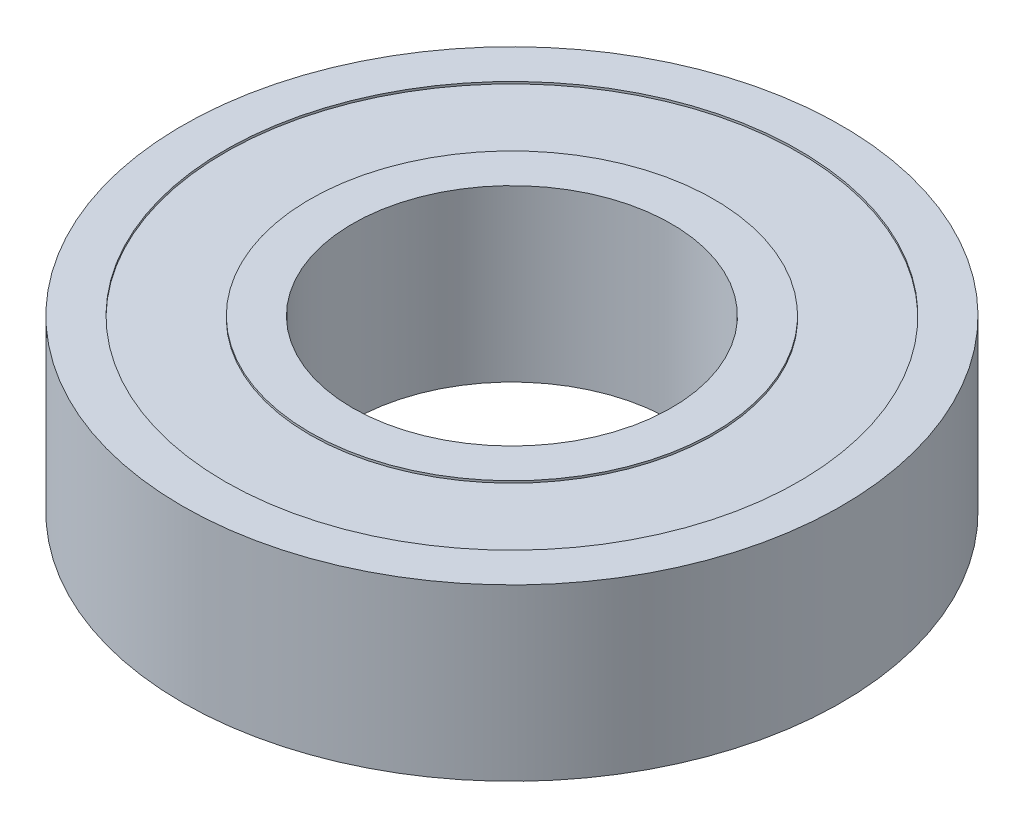
ISO-10303-21;
HEADER;
FILE_DESCRIPTION(('STEP AP214'),'2;1');
FILE_NAME('part.step','',(''),(''),'','','');
FILE_SCHEMA(('AUTOMOTIVE_DESIGN { 1 0 10303 214 1 1 1 1 }'));
ENDSEC;
DATA;
#1=APPLICATION_CONTEXT('core data for automotive mechanical design processes');
#2=APPLICATION_PROTOCOL_DEFINITION('international standard','automotive_design',2000,#1);
#3=PRODUCT_CONTEXT('',#1,'mechanical');
#4=PRODUCT('Part','Part','',(#3));
#5=PRODUCT_RELATED_PRODUCT_CATEGORY('part','',(#4));
#6=PRODUCT_DEFINITION_FORMATION('','',#4);
#7=PRODUCT_DEFINITION_CONTEXT('part definition',#1,'design');
#8=PRODUCT_DEFINITION('design','',#6,#7);
#9=PRODUCT_DEFINITION_SHAPE('','',#8);
#10=(LENGTH_UNIT() NAMED_UNIT(*) SI_UNIT(.MILLI.,.METRE.));
#11=(NAMED_UNIT(*) PLANE_ANGLE_UNIT() SI_UNIT($,.RADIAN.));
#12=(NAMED_UNIT(*) SI_UNIT($,.STERADIAN.) SOLID_ANGLE_UNIT());
#13=UNCERTAINTY_MEASURE_WITH_UNIT(LENGTH_MEASURE(1.E-05),#10,'distance_accuracy_value','');
#14=(GEOMETRIC_REPRESENTATION_CONTEXT(3) GLOBAL_UNCERTAINTY_ASSIGNED_CONTEXT((#13)) GLOBAL_UNIT_ASSIGNED_CONTEXT((#10,
#11,#12)) REPRESENTATION_CONTEXT('',''));
#15=CARTESIAN_POINT('',(0.,0.,0.));
#16=DIRECTION('',(0.,0.,1.));
#17=DIRECTION('',(1.,0.,0.));
#18=AXIS2_PLACEMENT_3D('',#15,#16,#17);
#19=CARTESIAN_POINT('',(27.,0.,0.));
#20=DIRECTION('',(0.,1.,0.));
#21=DIRECTION('',(0.,0.,1.));
#22=AXIS2_PLACEMENT_3D('',#19,#20,#21);
#23=PLANE('',#22);
#24=CARTESIAN_POINT('',(0.,0.,0.));
#25=DIRECTION('',(0.,1.,0.));
#26=DIRECTION('',(0.,0.,1.));
#27=AXIS2_PLACEMENT_3D('',#24,#25,#26);
#28=CIRCLE('',#27,31.);
#29=CARTESIAN_POINT('',(0.,0.,31.));
#30=VERTEX_POINT('',#29);
#31=EDGE_CURVE('E10',#30,#30,#28,.T.);
#32=ORIENTED_EDGE('',*,*,#31,.F.);
#33=EDGE_LOOP('',(#32));
#34=FACE_BOUND('',#33,.T.);
#35=CARTESIAN_POINT('',(0.,0.,0.));
#36=DIRECTION('',(0.,1.,0.));
#37=DIRECTION('',(0.,0.,1.));
#38=AXIS2_PLACEMENT_3D('',#35,#36,#37);
#39=CIRCLE('',#38,27.);
#40=CARTESIAN_POINT('',(0.,0.,27.));
#41=VERTEX_POINT('',#40);
#42=EDGE_CURVE('E94',#41,#41,#39,.T.);
#43=ORIENTED_EDGE('',*,*,#42,.T.);
#44=EDGE_LOOP('',(#43));
#45=FACE_BOUND('',#44,.T.);
#46=ADVANCED_FACE('F43',(#34,#45),#23,.F.);
#47=CARTESIAN_POINT('',(0.,16.0848812906443,0.));
#48=DIRECTION('',(0.,1.,0.));
#49=DIRECTION('',(0.,0.,1.));
#50=AXIS2_PLACEMENT_3D('',#47,#48,#49);
#51=CYLINDRICAL_SURFACE('',#50,31.);
#52=CARTESIAN_POINT('',(0.,16.,0.));
#53=DIRECTION('',(0.,1.,0.));
#54=DIRECTION('',(0.,0.,1.));
#55=AXIS2_PLACEMENT_3D('',#52,#53,#54);
#56=CIRCLE('',#55,31.);
#57=CARTESIAN_POINT('',(0.,16.,31.));
#58=VERTEX_POINT('',#57);
#59=EDGE_CURVE('E50',#58,#58,#56,.T.);
#60=ORIENTED_EDGE('',*,*,#59,.F.);
#61=EDGE_LOOP('',(#60));
#62=FACE_BOUND('',#61,.T.);
#63=ORIENTED_EDGE('',*,*,#31,.T.);
#64=EDGE_LOOP('',(#63));
#65=FACE_BOUND('',#64,.T.);
#66=ADVANCED_FACE('F156',(#62,#65),#51,.T.);
#67=CARTESIAN_POINT('',(31.,16.,0.));
#68=DIRECTION('',(0.,-1.,0.));
#69=DIRECTION('',(0.,0.,-1.));
#70=AXIS2_PLACEMENT_3D('',#67,#68,#69);
#71=PLANE('',#70);
#72=CARTESIAN_POINT('',(0.,16.,0.));
#73=DIRECTION('',(0.,1.,0.));
#74=DIRECTION('',(0.,0.,1.));
#75=AXIS2_PLACEMENT_3D('',#72,#73,#74);
#76=CIRCLE('',#75,27.);
#77=CARTESIAN_POINT('',(0.,16.,27.));
#78=VERTEX_POINT('',#77);
#79=EDGE_CURVE('E55',#78,#78,#76,.T.);
#80=ORIENTED_EDGE('',*,*,#79,.F.);
#81=EDGE_LOOP('',(#80));
#82=FACE_BOUND('',#81,.T.);
#83=ORIENTED_EDGE('',*,*,#59,.T.);
#84=EDGE_LOOP('',(#83));
#85=FACE_BOUND('',#84,.T.);
#86=ADVANCED_FACE('F151',(#82,#85),#71,.F.);
#87=CARTESIAN_POINT('',(0.,16.0848812906443,0.));
#88=DIRECTION('',(0.,1.,0.));
#89=DIRECTION('',(0.,0.,1.));
#90=AXIS2_PLACEMENT_3D('',#87,#88,#89);
#91=CYLINDRICAL_SURFACE('',#90,27.);
#92=CARTESIAN_POINT('',(0.,15.8,0.));
#93=DIRECTION('',(0.,1.,0.));
#94=DIRECTION('',(0.,0.,1.));
#95=AXIS2_PLACEMENT_3D('',#92,#93,#94);
#96=CIRCLE('',#95,27.);
#97=CARTESIAN_POINT('',(0.,15.8,27.));
#98=VERTEX_POINT('',#97);
#99=EDGE_CURVE('E60',#98,#98,#96,.T.);
#100=ORIENTED_EDGE('',*,*,#99,.F.);
#101=EDGE_LOOP('',(#100));
#102=FACE_BOUND('',#101,.T.);
#103=ORIENTED_EDGE('',*,*,#79,.T.);
#104=EDGE_LOOP('',(#103));
#105=FACE_BOUND('',#104,.T.);
#106=ADVANCED_FACE('F145',(#102,#105),#91,.F.);
#107=CARTESIAN_POINT('',(27.,15.8,0.));
#108=DIRECTION('',(0.,-1.,0.));
#109=DIRECTION('',(0.,0.,-1.));
#110=AXIS2_PLACEMENT_3D('',#107,#108,#109);
#111=PLANE('',#110);
#112=CARTESIAN_POINT('',(0.,15.8,0.));
#113=DIRECTION('',(0.,1.,0.));
#114=DIRECTION('',(0.,0.,1.));
#115=AXIS2_PLACEMENT_3D('',#112,#113,#114);
#116=CIRCLE('',#115,19.);
#117=CARTESIAN_POINT('',(0.,15.8,19.));
#118=VERTEX_POINT('',#117);
#119=EDGE_CURVE('E66',#118,#118,#116,.T.);
#120=ORIENTED_EDGE('',*,*,#119,.F.);
#121=EDGE_LOOP('',(#120));
#122=FACE_BOUND('',#121,.T.);
#123=ORIENTED_EDGE('',*,*,#99,.T.);
#124=EDGE_LOOP('',(#123));
#125=FACE_BOUND('',#124,.T.);
#126=ADVANCED_FACE('F139',(#122,#125),#111,.F.);
#127=CARTESIAN_POINT('',(0.,16.0848812906443,0.));
#128=DIRECTION('',(0.,1.,0.));
#129=DIRECTION('',(0.,0.,1.));
#130=AXIS2_PLACEMENT_3D('',#127,#128,#129);
#131=CYLINDRICAL_SURFACE('',#130,19.);
#132=CARTESIAN_POINT('',(0.,16.,0.));
#133=DIRECTION('',(0.,1.,0.));
#134=DIRECTION('',(0.,0.,1.));
#135=AXIS2_PLACEMENT_3D('',#132,#133,#134);
#136=CIRCLE('',#135,19.);
#137=CARTESIAN_POINT('',(0.,16.,19.));
#138=VERTEX_POINT('',#137);
#139=EDGE_CURVE('E70',#138,#138,#136,.T.);
#140=ORIENTED_EDGE('',*,*,#139,.F.);
#141=EDGE_LOOP('',(#140));
#142=FACE_BOUND('',#141,.T.);
#143=ORIENTED_EDGE('',*,*,#119,.T.);
#144=EDGE_LOOP('',(#143));
#145=FACE_BOUND('',#144,.T.);
#146=ADVANCED_FACE('F133',(#142,#145),#131,.T.);
#147=CARTESIAN_POINT('',(19.,16.,0.));
#148=DIRECTION('',(0.,-1.,0.));
#149=DIRECTION('',(0.,0.,-1.));
#150=AXIS2_PLACEMENT_3D('',#147,#148,#149);
#151=PLANE('',#150);
#152=CARTESIAN_POINT('',(0.,16.,0.));
#153=DIRECTION('',(0.,1.,0.));
#154=DIRECTION('',(0.,0.,1.));
#155=AXIS2_PLACEMENT_3D('',#152,#153,#154);
#156=CIRCLE('',#155,15.);
#157=CARTESIAN_POINT('',(0.,16.,15.));
#158=VERTEX_POINT('',#157);
#159=EDGE_CURVE('E74',#158,#158,#156,.T.);
#160=ORIENTED_EDGE('',*,*,#159,.F.);
#161=EDGE_LOOP('',(#160));
#162=FACE_BOUND('',#161,.T.);
#163=ORIENTED_EDGE('',*,*,#139,.T.);
#164=EDGE_LOOP('',(#163));
#165=FACE_BOUND('',#164,.T.);
#166=ADVANCED_FACE('F127',(#162,#165),#151,.F.);
#167=CARTESIAN_POINT('',(0.,16.0848812906443,0.));
#168=DIRECTION('',(0.,1.,0.));
#169=DIRECTION('',(0.,0.,1.));
#170=AXIS2_PLACEMENT_3D('',#167,#168,#169);
#171=CYLINDRICAL_SURFACE('',#170,15.);
#172=CARTESIAN_POINT('',(0.,0.,0.));
#173=DIRECTION('',(0.,1.,0.));
#174=DIRECTION('',(0.,0.,1.));
#175=AXIS2_PLACEMENT_3D('',#172,#173,#174);
#176=CIRCLE('',#175,15.);
#177=CARTESIAN_POINT('',(0.,0.,15.));
#178=VERTEX_POINT('',#177);
#179=EDGE_CURVE('E78',#178,#178,#176,.T.);
#180=ORIENTED_EDGE('',*,*,#179,.F.);
#181=EDGE_LOOP('',(#180));
#182=FACE_BOUND('',#181,.T.);
#183=ORIENTED_EDGE('',*,*,#159,.T.);
#184=EDGE_LOOP('',(#183));
#185=FACE_BOUND('',#184,.T.);
#186=ADVANCED_FACE('F121',(#182,#185),#171,.F.);
#187=CARTESIAN_POINT('',(15.,0.,0.));
#188=DIRECTION('',(0.,1.,0.));
#189=DIRECTION('',(0.,0.,1.));
#190=AXIS2_PLACEMENT_3D('',#187,#188,#189);
#191=PLANE('',#190);
#192=CARTESIAN_POINT('',(0.,0.,0.));
#193=DIRECTION('',(0.,1.,0.));
#194=DIRECTION('',(0.,0.,1.));
#195=AXIS2_PLACEMENT_3D('',#192,#193,#194);
#196=CIRCLE('',#195,19.);
#197=CARTESIAN_POINT('',(0.,0.,19.));
#198=VERTEX_POINT('',#197);
#199=EDGE_CURVE('E82',#198,#198,#196,.T.);
#200=ORIENTED_EDGE('',*,*,#199,.F.);
#201=EDGE_LOOP('',(#200));
#202=FACE_BOUND('',#201,.T.);
#203=ORIENTED_EDGE('',*,*,#179,.T.);
#204=EDGE_LOOP('',(#203));
#205=FACE_BOUND('',#204,.T.);
#206=ADVANCED_FACE('F115',(#202,#205),#191,.F.);
#207=CARTESIAN_POINT('',(0.,16.0848812906443,0.));
#208=DIRECTION('',(0.,1.,0.));
#209=DIRECTION('',(0.,0.,1.));
#210=AXIS2_PLACEMENT_3D('',#207,#208,#209);
#211=CYLINDRICAL_SURFACE('',#210,19.);
#212=CARTESIAN_POINT('',(0.,0.199999999999999,0.));
#213=DIRECTION('',(0.,1.,0.));
#214=DIRECTION('',(0.,0.,1.));
#215=AXIS2_PLACEMENT_3D('',#212,#213,#214);
#216=CIRCLE('',#215,19.);
#217=CARTESIAN_POINT('',(0.,0.199999999999999,19.));
#218=VERTEX_POINT('',#217);
#219=EDGE_CURVE('E86',#218,#218,#216,.T.);
#220=ORIENTED_EDGE('',*,*,#219,.F.);
#221=EDGE_LOOP('',(#220));
#222=FACE_BOUND('',#221,.T.);
#223=ORIENTED_EDGE('',*,*,#199,.T.);
#224=EDGE_LOOP('',(#223));
#225=FACE_BOUND('',#224,.T.);
#226=ADVANCED_FACE('F109',(#222,#225),#211,.T.);
#227=CARTESIAN_POINT('',(19.,0.2,0.));
#228=DIRECTION('',(0.,1.,0.));
#229=DIRECTION('',(0.,0.,1.));
#230=AXIS2_PLACEMENT_3D('',#227,#228,#229);
#231=PLANE('',#230);
#232=CARTESIAN_POINT('',(0.,0.199999999999999,0.));
#233=DIRECTION('',(0.,1.,0.));
#234=DIRECTION('',(0.,0.,1.));
#235=AXIS2_PLACEMENT_3D('',#232,#233,#234);
#236=CIRCLE('',#235,27.);
#237=CARTESIAN_POINT('',(0.,0.199999999999999,27.));
#238=VERTEX_POINT('',#237);
#239=EDGE_CURVE('E90',#238,#238,#236,.T.);
#240=ORIENTED_EDGE('',*,*,#239,.F.);
#241=EDGE_LOOP('',(#240));
#242=FACE_BOUND('',#241,.T.);
#243=ORIENTED_EDGE('',*,*,#219,.T.);
#244=EDGE_LOOP('',(#243));
#245=FACE_BOUND('',#244,.T.);
#246=ADVANCED_FACE('F103',(#242,#245),#231,.F.);
#247=CARTESIAN_POINT('',(0.,16.0848812906443,0.));
#248=DIRECTION('',(0.,1.,0.));
#249=DIRECTION('',(0.,0.,1.));
#250=AXIS2_PLACEMENT_3D('',#247,#248,#249);
#251=CYLINDRICAL_SURFACE('',#250,27.);
#252=ORIENTED_EDGE('',*,*,#42,.F.);
#253=EDGE_LOOP('',(#252));
#254=FACE_BOUND('',#253,.T.);
#255=ORIENTED_EDGE('',*,*,#239,.T.);
#256=EDGE_LOOP('',(#255));
#257=FACE_BOUND('',#256,.T.);
#258=ADVANCED_FACE('F100',(#254,#257),#251,.F.);
#259=CLOSED_SHELL('',(#46,#66,#86,#106,#126,#146,#166,#186,#206,#226,#246,#258));
#260=MANIFOLD_SOLID_BREP('B2',#259);
#261=ADVANCED_BREP_SHAPE_REPRESENTATION('',(#18,#260),#14);
#262=SHAPE_DEFINITION_REPRESENTATION(#9,#261);
ENDSEC;
END-ISO-10303-21;
